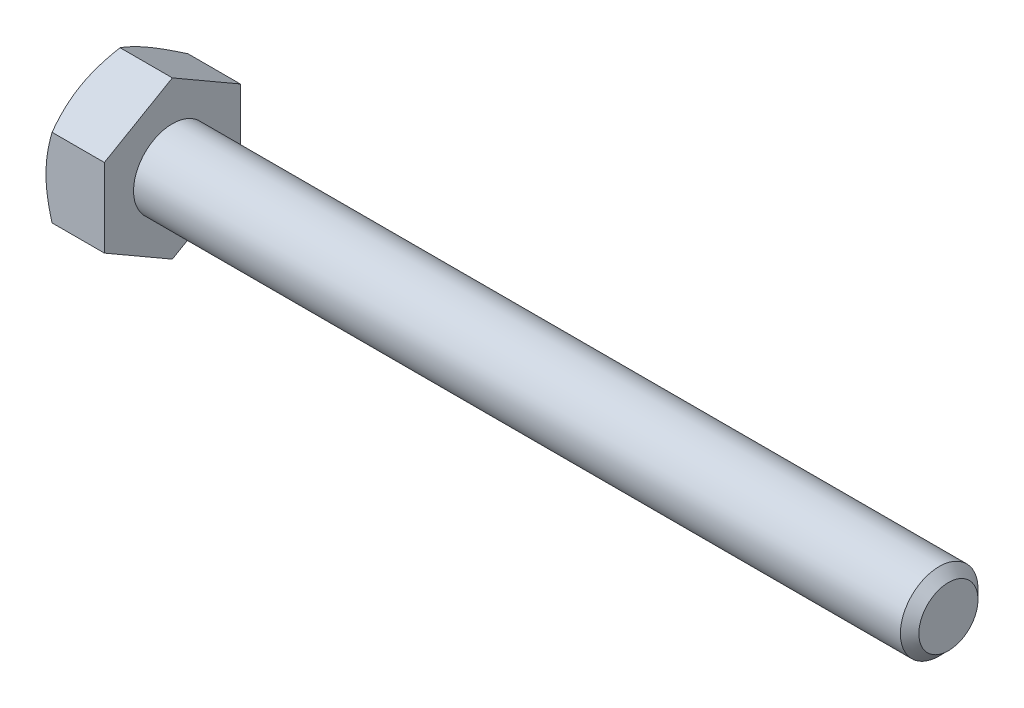
ISO-10303-21;
HEADER;
FILE_DESCRIPTION(('STEP AP214'),'2;1');
FILE_NAME('part.step','',(''),(''),'','','');
FILE_SCHEMA(('AUTOMOTIVE_DESIGN { 1 0 10303 214 1 1 1 1 }'));
ENDSEC;
DATA;
#1=APPLICATION_CONTEXT('core data for automotive mechanical design processes');
#2=APPLICATION_PROTOCOL_DEFINITION('international standard','automotive_design',2000,#1);
#3=PRODUCT_CONTEXT('',#1,'mechanical');
#4=PRODUCT('Part','Part','',(#3));
#5=PRODUCT_RELATED_PRODUCT_CATEGORY('part','',(#4));
#6=PRODUCT_DEFINITION_FORMATION('','',#4);
#7=PRODUCT_DEFINITION_CONTEXT('part definition',#1,'design');
#8=PRODUCT_DEFINITION('design','',#6,#7);
#9=PRODUCT_DEFINITION_SHAPE('','',#8);
#10=(LENGTH_UNIT() NAMED_UNIT(*) SI_UNIT(.MILLI.,.METRE.));
#11=(NAMED_UNIT(*) PLANE_ANGLE_UNIT() SI_UNIT($,.RADIAN.));
#12=(NAMED_UNIT(*) SI_UNIT($,.STERADIAN.) SOLID_ANGLE_UNIT());
#13=UNCERTAINTY_MEASURE_WITH_UNIT(LENGTH_MEASURE(1.E-05),#10,'distance_accuracy_value','');
#14=(GEOMETRIC_REPRESENTATION_CONTEXT(3) GLOBAL_UNCERTAINTY_ASSIGNED_CONTEXT((#13)) GLOBAL_UNIT_ASSIGNED_CONTEXT((#10,
#11,#12)) REPRESENTATION_CONTEXT('',''));
#15=CARTESIAN_POINT('',(0.,0.,0.));
#16=DIRECTION('',(0.,0.,1.));
#17=DIRECTION('',(1.,0.,0.));
#18=AXIS2_PLACEMENT_3D('',#15,#16,#17);
#19=CARTESIAN_POINT('',(4.7752,3.21156860739421,-5.5626));
#20=DIRECTION('',(0.,-0.866025403784438,0.500000000000001));
#21=DIRECTION('',(0.,-0.500000000000001,-0.866025403784438));
#22=AXIS2_PLACEMENT_3D('',#19,#20,#21);
#23=PLANE('',#22);
#24=CARTESIAN_POINT('',(0.496898061070143,6.42325268484227,0.0002));
#25=CARTESIAN_POINT('',(0.45614620225513,6.35265858120791,-0.122072574209491));
#26=CARTESIAN_POINT('',(0.417243775308723,6.2818012683745,-0.244801040124762));
#27=CARTESIAN_POINT('',(0.343647161560542,6.13951120287093,-0.491254662989243));
#28=CARTESIAN_POINT('',(0.308954790139044,6.06807821602765,-0.614980225538197));
#29=CARTESIAN_POINT('',(0.211873701066855,5.85263550648139,-0.98813794459262));
#30=CARTESIAN_POINT('',(0.156654841923373,5.70777535201369,-1.23904309212296));
#31=CARTESIAN_POINT('',(0.0919037861815275,5.49099476252075,-1.61451808721946));
#32=CARTESIAN_POINT('',(0.0734579983429333,5.41972205873199,-1.7379660313744));
#33=CARTESIAN_POINT('',(0.0425268916674615,5.27685459691414,-1.98541973399132));
#34=CARTESIAN_POINT('',(0.030041046189008,5.20525986790488,-2.10942544218948));
#35=CARTESIAN_POINT('',(0.0113480299394708,5.06194605565757,-2.35765224642821));
#36=CARTESIAN_POINT('',(0.00513373340584708,4.9902272065059,-2.48187293701928));
#37=CARTESIAN_POINT('',(-0.000889599359095551,4.84672720555795,-2.7304222295473));
#38=CARTESIAN_POINT('',(-0.000698833448296274,4.7749460557547,-2.85475082803225));
#39=CARTESIAN_POINT('',(0.00862810136342285,4.57828637012706,-3.19537539533985));
#40=CARTESIAN_POINT('',(0.0242873955350757,4.4534722013835,-3.41155987710816));
#41=CARTESIAN_POINT('',(0.0739443233816052,4.20467287416474,-3.84249295274001));
#42=CARTESIAN_POINT('',(0.107958931423458,4.08068859075412,-4.05724003094723));
#43=CARTESIAN_POINT('',(0.192986041409677,3.83138850679899,-4.4890404426887));
#44=CARTESIAN_POINT('',(0.244358813937401,3.70610416511176,-4.70603928788379));
#45=CARTESIAN_POINT('',(0.360954456999593,3.45740388365365,-5.13680081122592));
#46=CARTESIAN_POINT('',(0.426149937617058,3.33398475856357,-5.35056900650764));
#47=CARTESIAN_POINT('',(0.496898061070137,3.21145313734037,-5.5628));
#48=B_SPLINE_CURVE_WITH_KNOTS('',3,(#24,#25,#26,#27,#28,#29,#30,#31,#32,#33,#34,#35,#36,#37,#38,
#39,#40,#41,#42,#43,#44,#45,#46,#47),.UNSPECIFIED.,.F.,.F.,(4,2,2,2,2,2,2,2,2,2,2,4),(0.,
0.44082011856227,0.8818296488474,1.76568130465017,2.19678242164486,2.62784543796583,
3.05841812523868,3.48897751176353,4.23854798324166,4.98881282275669,5.75571809391027,
6.52111769989992),.UNSPECIFIED.);
#49=CARTESIAN_POINT('',(0.496831392605788,6.42313721478843,0.));
#50=VERTEX_POINT('',#49);
#51=CARTESIAN_POINT('',(0.,4.81735291109131,-2.78130000000001));
#52=VERTEX_POINT('',#51);
#53=EDGE_CURVE('E51',#50,#52,#48,.T.);
#54=ORIENTED_EDGE('',*,*,#53,.F.);
#55=DIRECTION('',(-1.,0.,0.));
#56=VECTOR('',#55,1.);
#57=CARTESIAN_POINT('',(4.7752,6.42313721478843,0.));
#58=LINE('',#57,#56);
#59=CARTESIAN_POINT('',(4.7752,6.42313721478843,0.));
#60=VERTEX_POINT('',#59);
#61=EDGE_CURVE('E147',#60,#50,#58,.T.);
#62=ORIENTED_EDGE('',*,*,#61,.F.);
#63=DIRECTION('',(0.,0.500000000000001,0.866025403784438));
#64=VECTOR('',#63,1.);
#65=CARTESIAN_POINT('',(4.7752,3.21156860739421,-5.5626));
#66=LINE('',#65,#64);
#67=CARTESIAN_POINT('',(4.7752,3.21156860739421,-5.5626));
#68=VERTEX_POINT('',#67);
#69=EDGE_CURVE('E238',#68,#60,#66,.T.);
#70=ORIENTED_EDGE('',*,*,#69,.F.);
#71=DIRECTION('',(-1.,0.,0.));
#72=VECTOR('',#71,1.);
#73=CARTESIAN_POINT('',(4.7752,3.21156860739421,-5.5626));
#74=LINE('',#73,#72);
#75=CARTESIAN_POINT('',(0.496831392605783,3.21156860739421,-5.5626));
#76=VERTEX_POINT('',#75);
#77=EDGE_CURVE('E135',#68,#76,#74,.T.);
#78=ORIENTED_EDGE('',*,*,#77,.T.);
#79=EDGE_CURVE('E129',#52,#76,#48,.T.);
#80=ORIENTED_EDGE('',*,*,#79,.F.);
#81=EDGE_LOOP('',(#54,#62,#70,#78,#80));
#82=FACE_BOUND('',#81,.T.);
#83=ADVANCED_FACE('F35',(#82),#23,.F.);
#84=CARTESIAN_POINT('',(4.7752,6.42313721478843,0.));
#85=DIRECTION('',(0.,-0.866025403784438,-0.500000000000001));
#86=DIRECTION('',(0.,0.500000000000001,-0.866025403784438));
#87=AXIS2_PLACEMENT_3D('',#84,#85,#86);
#88=PLANE('',#87);
#89=CARTESIAN_POINT('',(0.496898061070137,3.21145313734037,5.5628));
#90=CARTESIAN_POINT('',(0.456146202255126,3.28204724097473,5.44052742579051));
#91=CARTESIAN_POINT('',(0.417243775308719,3.35290455380814,5.31779895987524));
#92=CARTESIAN_POINT('',(0.343647161560538,3.49519461931171,5.07134533701076));
#93=CARTESIAN_POINT('',(0.30895479013904,3.56662760615498,4.9476197744618));
#94=CARTESIAN_POINT('',(0.211873701066851,3.78207031570124,4.57446205540738));
#95=CARTESIAN_POINT('',(0.156654841923371,3.92693047016895,4.32355690787704));
#96=CARTESIAN_POINT('',(0.0919037861815261,4.14371105966188,3.94808191278055));
#97=CARTESIAN_POINT('',(0.0734579983429319,4.21498376345064,3.82463396862561));
#98=CARTESIAN_POINT('',(0.0425268916674603,4.35785122526849,3.57718026600868));
#99=CARTESIAN_POINT('',(0.0300410461890069,4.42944595427775,3.45317455781052));
#100=CARTESIAN_POINT('',(0.0113480299394699,4.57275976652506,3.20494775357179));
#101=CARTESIAN_POINT('',(0.00513373340584611,4.64447861567674,3.08072706298073));
#102=CARTESIAN_POINT('',(-0.000889599359095831,4.78797861662468,2.8321777704527));
#103=CARTESIAN_POINT('',(-0.000698833448295828,4.85975976642794,2.70784917196775));
#104=CARTESIAN_POINT('',(0.00862810136342449,5.05641945205558,2.36722460466016));
#105=CARTESIAN_POINT('',(0.0242873955350772,5.18123362079914,2.15104012289184));
#106=CARTESIAN_POINT('',(0.0739443233816073,5.4300329480179,1.72010704725999));
#107=CARTESIAN_POINT('',(0.107958931423461,5.55401723142852,1.50535996905277));
#108=CARTESIAN_POINT('',(0.19298604140968,5.80331731538365,1.0735595573113));
#109=CARTESIAN_POINT('',(0.244358813937405,5.92860165707088,0.856560712116213));
#110=CARTESIAN_POINT('',(0.360954456999597,6.17730193852899,0.425799188774084));
#111=CARTESIAN_POINT('',(0.426149937617063,6.30072106361907,0.212030993492364));
#112=CARTESIAN_POINT('',(0.496898061070143,6.42325268484227,-0.000200000000000001));
#113=B_SPLINE_CURVE_WITH_KNOTS('',3,(#89,#90,#91,#92,#93,#94,#95,#96,#97,#98,#99,#100,#101,#102,
#103,#104,#105,#106,#107,#108,#109,#110,#111,#112),.UNSPECIFIED.,.F.,.F.,(4,2,2,2,2,2,2,2,2,2,2,
4),(0.,0.440820118562269,0.881829648847399,1.76568130465016,2.19678242164486,2.62784543796582,
3.05841812523867,3.48897751176352,4.23854798324166,4.98881282275669,5.75571809391027,
6.52111769989992),.UNSPECIFIED.);
#114=CARTESIAN_POINT('',(0.496831392605783,3.21156860739421,5.5626));
#115=VERTEX_POINT('',#114);
#116=CARTESIAN_POINT('',(0.,4.81735291109131,2.78130000000001));
#117=VERTEX_POINT('',#116);
#118=EDGE_CURVE('E58',#115,#117,#113,.T.);
#119=ORIENTED_EDGE('',*,*,#118,.F.);
#120=DIRECTION('',(-1.,0.,0.));
#121=VECTOR('',#120,1.);
#122=CARTESIAN_POINT('',(4.7752,3.21156860739421,5.5626));
#123=LINE('',#122,#121);
#124=CARTESIAN_POINT('',(4.7752,3.21156860739421,5.5626));
#125=VERTEX_POINT('',#124);
#126=EDGE_CURVE('E145',#125,#115,#123,.T.);
#127=ORIENTED_EDGE('',*,*,#126,.F.);
#128=DIRECTION('',(0.,-0.500000000000001,0.866025403784438));
#129=VECTOR('',#128,1.);
#130=CARTESIAN_POINT('',(4.7752,6.42313721478843,0.));
#131=LINE('',#130,#129);
#132=EDGE_CURVE('E236',#60,#125,#131,.T.);
#133=ORIENTED_EDGE('',*,*,#132,.F.);
#134=ORIENTED_EDGE('',*,*,#61,.T.);
#135=EDGE_CURVE('E162',#117,#50,#113,.T.);
#136=ORIENTED_EDGE('',*,*,#135,.F.);
#137=EDGE_LOOP('',(#119,#127,#133,#134,#136));
#138=FACE_BOUND('',#137,.T.);
#139=ADVANCED_FACE('F168',(#138),#88,.F.);
#140=CARTESIAN_POINT('',(4.7752,3.21156860739421,5.5626));
#141=DIRECTION('',(0.,0.,-1.));
#142=DIRECTION('',(0.,1.,0.));
#143=AXIS2_PLACEMENT_3D('',#140,#141,#142);
#144=PLANE('',#143);
#145=CARTESIAN_POINT('',(2.76946298300578,-8.7393190750818,5.5626));
#146=CARTESIAN_POINT('',(2.65067477861527,-8.49536496655185,5.5626));
#147=CARTESIAN_POINT('',(2.53299354463682,-8.25086273482907,5.5626));
#148=CARTESIAN_POINT('',(2.30046552472367,-7.7604709003827,5.5626));
#149=CARTESIAN_POINT('',(2.18561916460972,-7.51458109596807,5.5626));
#150=CARTESIAN_POINT('',(1.9588276573177,-7.01990967875911,5.5626));
#151=CARTESIAN_POINT('',(1.84690075513499,-6.77111967311546,5.5626));
#152=CARTESIAN_POINT('',(1.62748022476041,-6.27159952967086,5.5626));
#153=CARTESIAN_POINT('',(1.51998639425647,-6.02086948102923,5.5626));
#154=CARTESIAN_POINT('',(1.30708686388974,-5.50862062722722,5.5626));
#155=CARTESIAN_POINT('',(1.20187213532634,-5.24702202923404,5.5626));
#156=CARTESIAN_POINT('',(0.999136459179914,-4.72080610855177,5.5626));
#157=CARTESIAN_POINT('',(0.901616358819185,-4.45618845710902,5.5626));
#158=CARTESIAN_POINT('',(0.716747077259983,-3.92397402708936,5.5626));
#159=CARTESIAN_POINT('',(0.629378259967496,-3.65638413524642,5.5626));
#160=CARTESIAN_POINT('',(0.467540995587162,-3.11736467473257,5.5626));
#161=CARTESIAN_POINT('',(0.393068604009403,-2.84593630766607,5.5626));
#162=CARTESIAN_POINT('',(0.260913640631057,-2.30059524064209,5.5626));
#163=CARTESIAN_POINT('',(0.203137923936712,-2.02670547200284,5.5626));
#164=CARTESIAN_POINT('',(0.107584140927259,-1.47536640564423,5.5626));
#165=CARTESIAN_POINT('',(0.0698039297389937,-1.19791749297778,5.5626));
#166=CARTESIAN_POINT('',(0.0306329032322198,-0.782024036094212,5.5626));
#167=CARTESIAN_POINT('',(0.0205033243625241,-0.644369602420743,5.5626));
#168=CARTESIAN_POINT('',(0.00607539244269754,-0.368760083391723,5.5626));
#169=CARTESIAN_POINT('',(0.00177648777087112,-0.230805027714104,5.5626));
#170=CARTESIAN_POINT('',(-0.000882415982739105,0.0451740127451351,5.5626));
#171=CARTESIAN_POINT('',(0.000758104232646437,0.183198002498892,5.5626));
#172=CARTESIAN_POINT('',(0.0099357013266243,0.459040079963629,5.5626));
#173=CARTESIAN_POINT('',(0.017472551860389,0.596858175374894,5.5626));
#174=CARTESIAN_POINT('',(0.0422505229084576,0.924672768817545,5.5626));
#175=CARTESIAN_POINT('',(0.0620998983879061,1.11447655248114,5.5626));
#176=CARTESIAN_POINT('',(0.111925243816852,1.49274006022234,5.5626));
#177=CARTESIAN_POINT('',(0.141902493413722,1.68119961138342,5.5626));
#178=CARTESIAN_POINT('',(0.24544179513394,2.24430469271528,5.5626));
#179=CARTESIAN_POINT('',(0.332595182135706,2.61648784181075,5.5626));
#180=CARTESIAN_POINT('',(0.484580657527375,3.17327423362328,5.5626));
#181=CARTESIAN_POINT('',(0.53953514834987,3.3607403414357,5.5626));
#182=CARTESIAN_POINT('',(0.655361857948686,3.73385345534553,5.5626));
#183=CARTESIAN_POINT('',(0.716234121733455,3.91950044759557,5.5626));
#184=CARTESIAN_POINT('',(0.842902269493743,4.28903174270243,5.5626));
#185=CARTESIAN_POINT('',(0.908696734383907,4.47291653649099,5.5626));
#186=CARTESIAN_POINT('',(1.04441413366768,4.83914665056041,5.5626));
#187=CARTESIAN_POINT('',(1.11433697738278,5.02149200455408,5.5626));
#188=CARTESIAN_POINT('',(1.30616254258249,5.50788800286082,5.5626));
#189=CARTESIAN_POINT('',(1.43118964362203,5.81070522079332,5.5626));
#190=CARTESIAN_POINT('',(1.68847909941209,6.41326146735257,5.5626));
#191=CARTESIAN_POINT('',(1.82074222486502,6.71300016403481,5.5626));
#192=CARTESIAN_POINT('',(2.09080854484645,7.31009693194883,5.5626));
#193=CARTESIAN_POINT('',(2.2286137757305,7.6074540790974,5.5626));
#194=CARTESIAN_POINT('',(2.50845292691855,8.200151033603,5.5626));
#195=CARTESIAN_POINT('',(2.65048668230203,8.49549091908618,5.5626));
#196=CARTESIAN_POINT('',(2.93809441213762,9.08501121353831,5.5626));
#197=CARTESIAN_POINT('',(3.08367358186693,9.37918908275013,5.5626));
#198=CARTESIAN_POINT('',(3.37748078904249,9.96621951864085,5.5626));
#199=CARTESIAN_POINT('',(3.52570884757214,10.2590720747479,5.5626));
#200=CARTESIAN_POINT('',(3.97349977904317,11.1358830052649,5.5626));
#201=CARTESIAN_POINT('',(4.27623214178692,11.7182219945537,5.5626));
#202=CARTESIAN_POINT('',(4.85550678228881,12.8193647810355,5.5626));
#203=CARTESIAN_POINT('',(5.13148986853602,13.3384641758492,5.5626));
#204=CARTESIAN_POINT('',(5.68680572895233,14.3749069872875,5.5626));
#205=CARTESIAN_POINT('',(5.96613870161307,14.8922502975047,5.5626));
#206=CARTESIAN_POINT('',(6.52636532741208,15.9238879385591,5.5626));
#207=CARTESIAN_POINT('',(6.80725083144907,16.4381867017065,5.5626));
#208=CARTESIAN_POINT('',(7.37092859266393,17.4656872191565,5.5626));
#209=CARTESIAN_POINT('',(7.65372070150566,17.9788890548015,5.5626));
#210=CARTESIAN_POINT('',(7.93720779623422,18.4917042787924,5.5626));
#211=B_SPLINE_CURVE_WITH_KNOTS('',3,(#145,#146,#147,#148,#149,#150,#151,#152,#153,#154,#155,
#156,#157,#158,#159,#160,#161,#162,#163,#164,#165,#166,#167,#168,#169,#170,#171,#172,#173,#174,
#175,#176,#177,#178,#179,#180,#181,#182,#183,#184,#185,#186,#187,#188,#189,#190,#191,#192,#193,
#194,#195,#196,#197,#198,#199,#200,#201,#202,#203,#204,#205,#206,#207,#208,#209,#210),
.UNSPECIFIED.,.F.,.F.,(4,2,2,2,2,2,2,2,2,2,2,2,2,2,2,2,2,2,2,2,2,2,2,2,2,2,2,2,2,2,2,2,4),(0.,
0.814023059896039,1.62816765754195,2.44655638702215,3.26490772627512,4.11070764230637,
4.95660055613667,5.80082897545883,6.64479872196119,7.48396511886282,8.32304148200848,
8.73701668482869,9.15095272002817,9.56492494745271,9.97888128433686,10.5510771721585,
11.1233453834466,12.2684477479276,12.8544603660259,13.4404774414739,14.0263262127401,
14.6121621208114,15.5948602808078,16.5776633116356,17.5608308169621,18.5439600269871,
19.5286286939573,20.5133052017346,22.4822323672198,24.245931208995,26.0097350771296,
27.7677407362569,29.5256111634693),.UNSPECIFIED.);
#212=CARTESIAN_POINT('',(0.496831392605779,-3.21156860739419,5.5626));
#213=VERTEX_POINT('',#212);
#214=CARTESIAN_POINT('',(0.,0.,5.5626));
#215=VERTEX_POINT('',#214);
#216=EDGE_CURVE('E248',#213,#215,#211,.T.);
#217=ORIENTED_EDGE('',*,*,#216,.F.);
#218=DIRECTION('',(-1.,0.,0.));
#219=VECTOR('',#218,1.);
#220=CARTESIAN_POINT('',(4.7752,-3.21156860739419,5.5626));
#221=LINE('',#220,#219);
#222=CARTESIAN_POINT('',(4.7752,-3.21156860739419,5.5626));
#223=VERTEX_POINT('',#222);
#224=EDGE_CURVE('E137',#223,#213,#221,.T.);
#225=ORIENTED_EDGE('',*,*,#224,.F.);
#226=DIRECTION('',(0.,-1.,0.));
#227=VECTOR('',#226,1.);
#228=CARTESIAN_POINT('',(4.7752,3.21156860739421,5.5626));
#229=LINE('',#228,#227);
#230=EDGE_CURVE('E232',#125,#223,#229,.T.);
#231=ORIENTED_EDGE('',*,*,#230,.F.);
#232=ORIENTED_EDGE('',*,*,#126,.T.);
#233=EDGE_CURVE('E186',#215,#115,#211,.T.);
#234=ORIENTED_EDGE('',*,*,#233,.F.);
#235=EDGE_LOOP('',(#217,#225,#231,#232,#234));
#236=FACE_BOUND('',#235,.T.);
#237=ADVANCED_FACE('F254',(#236),#144,.F.);
#238=CARTESIAN_POINT('',(4.7752,-6.42313721478842,0.));
#239=DIRECTION('',(0.,0.866025403784438,-0.500000000000002));
#240=DIRECTION('',(0.,0.500000000000002,0.866025403784438));
#241=AXIS2_PLACEMENT_3D('',#238,#239,#240);
#242=PLANE('',#241);
#243=CARTESIAN_POINT('',(0.496898061070138,-6.42325268484226,-0.000200000000000038));
#244=CARTESIAN_POINT('',(0.456146202255126,-6.3526585812079,0.122072574209491));
#245=CARTESIAN_POINT('',(0.417243775308719,-6.28180126837449,0.244801040124762));
#246=CARTESIAN_POINT('',(0.343647161560538,-6.13951120287092,0.491254662989243));
#247=CARTESIAN_POINT('',(0.30895479013904,-6.06807821602765,0.614980225538197));
#248=CARTESIAN_POINT('',(0.21187370106685,-5.85263550648139,0.988137944592619));
#249=CARTESIAN_POINT('',(0.156654841923369,-5.70777535201368,1.23904309212296));
#250=CARTESIAN_POINT('',(0.0919037861815231,-5.49099476252075,1.61451808721945));
#251=CARTESIAN_POINT('',(0.0734579983429287,-5.41972205873199,1.73796603137439));
#252=CARTESIAN_POINT('',(0.0425268916674567,-5.27685459691413,1.98541973399132));
#253=CARTESIAN_POINT('',(0.0300410461890033,-5.20525986790488,2.10942544218948));
#254=CARTESIAN_POINT('',(0.0113480299394658,-5.06194605565756,2.35765224642821));
#255=CARTESIAN_POINT('',(0.00513373340584158,-4.99022720650589,2.48187293701927));
#256=CARTESIAN_POINT('',(-0.00088959935910106,-4.84672720555795,2.73042222954729));
#257=CARTESIAN_POINT('',(-0.000698833448301401,-4.77494605575469,2.85475082803225));
#258=CARTESIAN_POINT('',(0.00862810136341809,-4.57828637012705,3.19537539533984));
#259=CARTESIAN_POINT('',(0.0242873955350705,-4.45347220138349,3.41155987710816));
#260=CARTESIAN_POINT('',(0.0739443233815994,-4.20467287416473,3.84249295274001));
#261=CARTESIAN_POINT('',(0.107958931423452,-4.08068859075411,4.05724003094722));
#262=CARTESIAN_POINT('',(0.192986041409671,-3.83138850679897,4.48904044268869));
#263=CARTESIAN_POINT('',(0.244358813937396,-3.70610416511175,4.70603928788379));
#264=CARTESIAN_POINT('',(0.360954456999589,-3.45740388365364,5.13680081122591));
#265=CARTESIAN_POINT('',(0.426149937617054,-3.33398475856356,5.35056900650764));
#266=CARTESIAN_POINT('',(0.496898061070133,-3.21145313734036,5.5628));
#267=B_SPLINE_CURVE_WITH_KNOTS('',3,(#243,#244,#245,#246,#247,#248,#249,#250,#251,#252,#253,
#254,#255,#256,#257,#258,#259,#260,#261,#262,#263,#264,#265,#266),.UNSPECIFIED.,.F.,.F.,(4,2,2,
2,2,2,2,2,2,2,2,4),(0.,0.44082011856227,0.881829648847399,1.76568130465016,2.19678242164486,
2.62784543796583,3.05841812523868,3.48897751176352,4.23854798324166,4.98881282275669,
5.75571809391028,6.52111769989993),.UNSPECIFIED.);
#268=CARTESIAN_POINT('',(0.496831392605783,-6.42313721478842,0.));
#269=VERTEX_POINT('',#268);
#270=CARTESIAN_POINT('',(0.,-4.81735291109131,2.78130000000001));
#271=VERTEX_POINT('',#270);
#272=EDGE_CURVE('E170',#269,#271,#267,.T.);
#273=ORIENTED_EDGE('',*,*,#272,.F.);
#274=DIRECTION('',(-1.,0.,0.));
#275=VECTOR('',#274,1.);
#276=CARTESIAN_POINT('',(4.7752,-6.42313721478842,0.));
#277=LINE('',#276,#275);
#278=CARTESIAN_POINT('',(4.7752,-6.42313721478842,0.));
#279=VERTEX_POINT('',#278);
#280=EDGE_CURVE('E134',#279,#269,#277,.T.);
#281=ORIENTED_EDGE('',*,*,#280,.F.);
#282=DIRECTION('',(0.,-0.500000000000002,-0.866025403784438));
#283=VECTOR('',#282,1.);
#284=CARTESIAN_POINT('',(4.7752,-6.42313721478842,0.));
#285=LINE('',#284,#283);
#286=EDGE_CURVE('E230',#223,#279,#285,.T.);
#287=ORIENTED_EDGE('',*,*,#286,.F.);
#288=ORIENTED_EDGE('',*,*,#224,.T.);
#289=EDGE_CURVE('E172',#271,#213,#267,.T.);
#290=ORIENTED_EDGE('',*,*,#289,.F.);
#291=EDGE_LOOP('',(#273,#281,#287,#288,#290));
#292=FACE_BOUND('',#291,.T.);
#293=ADVANCED_FACE('F226',(#292),#242,.F.);
#294=CARTESIAN_POINT('',(4.7752,-3.21156860739422,-5.5626));
#295=DIRECTION('',(0.,0.866025403784439,0.499999999999999));
#296=DIRECTION('',(0.,-0.499999999999999,0.866025403784439));
#297=AXIS2_PLACEMENT_3D('',#294,#295,#296);
#298=PLANE('',#297);
#299=CARTESIAN_POINT('',(0.49689806107014,-3.21145313734038,-5.5628));
#300=CARTESIAN_POINT('',(0.456146202255128,-3.28204724097474,-5.44052742579051));
#301=CARTESIAN_POINT('',(0.417243775308721,-3.35290455380815,-5.31779895987524));
#302=CARTESIAN_POINT('',(0.343647161560541,-3.49519461931171,-5.07134533701076));
#303=CARTESIAN_POINT('',(0.308954790139042,-3.56662760615499,-4.9476197744618));
#304=CARTESIAN_POINT('',(0.211873701066853,-3.78207031570125,-4.57446205540738));
#305=CARTESIAN_POINT('',(0.156654841923372,-3.92693047016895,-4.32355690787704));
#306=CARTESIAN_POINT('',(0.0919037861815272,-4.14371105966189,-3.94808191278054));
#307=CARTESIAN_POINT('',(0.0734579983429331,-4.21498376345065,-3.8246339686256));
#308=CARTESIAN_POINT('',(0.0425268916674613,-4.3578512252685,-3.57718026600868));
#309=CARTESIAN_POINT('',(0.0300410461890077,-4.42944595427776,-3.45317455781052));
#310=CARTESIAN_POINT('',(0.0113480299394704,-4.57275976652507,-3.20494775357179));
#311=CARTESIAN_POINT('',(0.00513373340584659,-4.64447861567674,-3.08072706298072));
#312=CARTESIAN_POINT('',(-0.000889599359095559,-4.78797861662469,-2.8321777704527));
#313=CARTESIAN_POINT('',(-0.000698833448295763,-4.85975976642794,-2.70784917196775));
#314=CARTESIAN_POINT('',(0.00862810136342402,-5.05641945205558,-2.36722460466015));
#315=CARTESIAN_POINT('',(0.0242873955350764,-5.18123362079914,-2.15104012289184));
#316=CARTESIAN_POINT('',(0.0739443233816055,-5.4300329480179,-1.72010704725999));
#317=CARTESIAN_POINT('',(0.107958931423458,-5.55401723142852,-1.50535996905277));
#318=CARTESIAN_POINT('',(0.192986041409677,-5.80331731538365,-1.0735595573113));
#319=CARTESIAN_POINT('',(0.244358813937401,-5.92860165707087,-0.856560712116213));
#320=CARTESIAN_POINT('',(0.360954456999593,-6.17730193852898,-0.425799188774084));
#321=CARTESIAN_POINT('',(0.426149937617058,-6.30072106361906,-0.212030993492364));
#322=CARTESIAN_POINT('',(0.496898061070137,-6.42325268484226,0.000199999999999785));
#323=B_SPLINE_CURVE_WITH_KNOTS('',3,(#299,#300,#301,#302,#303,#304,#305,#306,#307,#308,#309,
#310,#311,#312,#313,#314,#315,#316,#317,#318,#319,#320,#321,#322),.UNSPECIFIED.,.F.,.F.,(4,2,2,
2,2,2,2,2,2,2,2,4),(0.,0.44082011856227,0.881829648847399,1.76568130465016,2.19678242164486,
2.62784543796583,3.05841812523868,3.48897751176353,4.23854798324166,4.98881282275669,
5.75571809391027,6.52111769989992),.UNSPECIFIED.);
#324=CARTESIAN_POINT('',(0.496831392605577,-3.21156860739453,-5.5626));
#325=VERTEX_POINT('',#324);
#326=CARTESIAN_POINT('',(0.,-4.81735291109132,-2.7813));
#327=VERTEX_POINT('',#326);
#328=EDGE_CURVE('E111',#325,#327,#323,.T.);
#329=ORIENTED_EDGE('',*,*,#328,.F.);
#330=DIRECTION('',(-1.,0.,0.));
#331=VECTOR('',#330,1.);
#332=CARTESIAN_POINT('',(4.7752,-3.21156860739422,-5.5626));
#333=LINE('',#332,#331);
#334=CARTESIAN_POINT('',(4.7752,-3.21156860739422,-5.5626));
#335=VERTEX_POINT('',#334);
#336=EDGE_CURVE('E125',#335,#325,#333,.T.);
#337=ORIENTED_EDGE('',*,*,#336,.F.);
#338=DIRECTION('',(0.,0.499999999999999,-0.866025403784439));
#339=VECTOR('',#338,1.);
#340=CARTESIAN_POINT('',(4.7752,-3.21156860739422,-5.5626));
#341=LINE('',#340,#339);
#342=EDGE_CURVE('E228',#279,#335,#341,.T.);
#343=ORIENTED_EDGE('',*,*,#342,.F.);
#344=ORIENTED_EDGE('',*,*,#280,.T.);
#345=EDGE_CURVE('E128',#327,#269,#323,.T.);
#346=ORIENTED_EDGE('',*,*,#345,.F.);
#347=EDGE_LOOP('',(#329,#337,#343,#344,#346));
#348=FACE_BOUND('',#347,.T.);
#349=ADVANCED_FACE('F123',(#348),#298,.F.);
#350=CARTESIAN_POINT('',(4.7752,3.21156860739421,-5.5626));
#351=DIRECTION('',(0.,0.,1.));
#352=DIRECTION('',(0.,-1.,0.));
#353=AXIS2_PLACEMENT_3D('',#350,#351,#352);
#354=PLANE('',#353);
#355=CARTESIAN_POINT('',(2.76946298300579,-8.73931907508182,-5.5626));
#356=CARTESIAN_POINT('',(2.65067477861528,-8.49536496655187,-5.5626));
#357=CARTESIAN_POINT('',(2.53299354463683,-8.25086273482909,-5.5626));
#358=CARTESIAN_POINT('',(2.30046552472368,-7.76047090038273,-5.5626));
#359=CARTESIAN_POINT('',(2.18561916460973,-7.51458109596809,-5.5626));
#360=CARTESIAN_POINT('',(1.95882765731771,-7.01990967875913,-5.5626));
#361=CARTESIAN_POINT('',(1.846900755135,-6.77111967311548,-5.5626));
#362=CARTESIAN_POINT('',(1.62748022476042,-6.27159952967089,-5.5626));
#363=CARTESIAN_POINT('',(1.51998639425648,-6.02086948102925,-5.5626));
#364=CARTESIAN_POINT('',(1.30708686388975,-5.50862062722724,-5.5626));
#365=CARTESIAN_POINT('',(1.20187213532635,-5.24702202923406,-5.5626));
#366=CARTESIAN_POINT('',(0.999136459179921,-4.72080610855179,-5.5626));
#367=CARTESIAN_POINT('',(0.901616358819192,-4.45618845710904,-5.5626));
#368=CARTESIAN_POINT('',(0.716747077259989,-3.92397402708938,-5.5626));
#369=CARTESIAN_POINT('',(0.629378259967502,-3.65638413524644,-5.5626));
#370=CARTESIAN_POINT('',(0.467540995587167,-3.11736467473259,-5.5626));
#371=CARTESIAN_POINT('',(0.393068604009408,-2.84593630766609,-5.5626));
#372=CARTESIAN_POINT('',(0.260913640631061,-2.3005952406421,-5.5626));
#373=CARTESIAN_POINT('',(0.203137923936715,-2.02670547200286,-5.5626));
#374=CARTESIAN_POINT('',(0.107584140927261,-1.47536640564425,-5.5626));
#375=CARTESIAN_POINT('',(0.0698039297389959,-1.19791749297779,-5.5626));
#376=CARTESIAN_POINT('',(0.0306329032322217,-0.782024036094228,-5.5626));
#377=CARTESIAN_POINT('',(0.0205033243625259,-0.644369602420759,-5.5626));
#378=CARTESIAN_POINT('',(0.00607539244269882,-0.368760083391737,-5.5626));
#379=CARTESIAN_POINT('',(0.00177648777087202,-0.230805027714119,-5.5626));
#380=CARTESIAN_POINT('',(-0.000882415982738997,0.0451740127451205,-5.5626));
#381=CARTESIAN_POINT('',(0.000758104232646156,0.183198002498878,-5.5626));
#382=CARTESIAN_POINT('',(0.00993570132662356,0.459040079963614,-5.5626));
#383=CARTESIAN_POINT('',(0.0174725518603882,0.596858175374879,-5.5626));
#384=CARTESIAN_POINT('',(0.0422505229084564,0.924672768817529,-5.5626));
#385=CARTESIAN_POINT('',(0.0620998983879045,1.11447655248113,-5.5626));
#386=CARTESIAN_POINT('',(0.111925243816849,1.49274006022233,-5.5626));
#387=CARTESIAN_POINT('',(0.141902493413719,1.6811996113834,-5.5626));
#388=CARTESIAN_POINT('',(0.245441795133936,2.24430469271526,-5.5626));
#389=CARTESIAN_POINT('',(0.332595182135701,2.61648784181073,-5.5626));
#390=CARTESIAN_POINT('',(0.484580657527369,3.17327423362326,-5.5626));
#391=CARTESIAN_POINT('',(0.539535148349865,3.36074034143568,-5.5626));
#392=CARTESIAN_POINT('',(0.655361857948679,3.7338534553455,-5.5626));
#393=CARTESIAN_POINT('',(0.716234121733449,3.91950044759555,-5.5626));
#394=CARTESIAN_POINT('',(0.842902269493736,4.28903174270241,-5.5626));
#395=CARTESIAN_POINT('',(0.908696734383899,4.47291653649097,-5.5626));
#396=CARTESIAN_POINT('',(1.04441413366767,4.83914665056038,-5.5626));
#397=CARTESIAN_POINT('',(1.11433697738277,5.02149200455406,-5.5626));
#398=CARTESIAN_POINT('',(1.30616254258248,5.5078880028608,-5.5626));
#399=CARTESIAN_POINT('',(1.43118964362202,5.81070522079329,-5.5626));
#400=CARTESIAN_POINT('',(1.68847909941208,6.41326146735254,-5.5626));
#401=CARTESIAN_POINT('',(1.82074222486501,6.71300016403479,-5.5626));
#402=CARTESIAN_POINT('',(2.09080854484644,7.31009693194881,-5.5626));
#403=CARTESIAN_POINT('',(2.22861377573049,7.60745407909738,-5.5626));
#404=CARTESIAN_POINT('',(2.50845292691854,8.20015103360298,-5.5626));
#405=CARTESIAN_POINT('',(2.65048668230202,8.49549091908616,-5.5626));
#406=CARTESIAN_POINT('',(2.93809441213761,9.08501121353829,-5.5626));
#407=CARTESIAN_POINT('',(3.08367358186692,9.37918908275011,-5.5626));
#408=CARTESIAN_POINT('',(3.37748078904248,9.96621951864084,-5.5626));
#409=CARTESIAN_POINT('',(3.52570884757214,10.2590720747478,-5.5626));
#410=CARTESIAN_POINT('',(3.97349977904316,11.1358830052649,-5.5626));
#411=CARTESIAN_POINT('',(4.27623214178691,11.7182219945536,-5.5626));
#412=CARTESIAN_POINT('',(4.8555067822888,12.8193647810355,-5.5626));
#413=CARTESIAN_POINT('',(5.13148986853601,13.3384641758492,-5.5626));
#414=CARTESIAN_POINT('',(5.68680572895232,14.3749069872875,-5.5626));
#415=CARTESIAN_POINT('',(5.96613870161306,14.8922502975047,-5.5626));
#416=CARTESIAN_POINT('',(6.52636532741208,15.9238879385591,-5.5626));
#417=CARTESIAN_POINT('',(6.80725083144907,16.4381867017065,-5.5626));
#418=CARTESIAN_POINT('',(7.37092859266394,17.4656872191565,-5.5626));
#419=CARTESIAN_POINT('',(7.65372070150567,17.9788890548015,-5.5626));
#420=CARTESIAN_POINT('',(7.93720779623422,18.4917042787924,-5.5626));
#421=B_SPLINE_CURVE_WITH_KNOTS('',3,(#355,#356,#357,#358,#359,#360,#361,#362,#363,#364,#365,
#366,#367,#368,#369,#370,#371,#372,#373,#374,#375,#376,#377,#378,#379,#380,#381,#382,#383,#384,
#385,#386,#387,#388,#389,#390,#391,#392,#393,#394,#395,#396,#397,#398,#399,#400,#401,#402,#403,
#404,#405,#406,#407,#408,#409,#410,#411,#412,#413,#414,#415,#416,#417,#418,#419,#420),
.UNSPECIFIED.,.F.,.F.,(4,2,2,2,2,2,2,2,2,2,2,2,2,2,2,2,2,2,2,2,2,2,2,2,2,2,2,2,2,2,2,2,4),(0.,
0.814023059896039,1.62816765754195,2.44655638702216,3.26490772627512,4.11070764230638,
4.95660055613668,5.80082897545884,6.6447987219612,7.48396511886283,8.32304148200849,
8.7370166848287,9.15095272002818,9.56492494745272,9.97888128433688,10.5510771721585,
11.1233453834466,12.2684477479276,12.8544603660259,13.4404774414739,14.0263262127401,
14.6121621208114,15.5948602808078,16.5776633116356,17.5608308169621,18.5439600269871,
19.5286286939574,20.5133052017346,22.4822323672198,24.245931208995,26.0097350771296,
27.7677407362569,29.5256111634693),.UNSPECIFIED.);
#422=CARTESIAN_POINT('',(0.,0.,-5.5626));
#423=VERTEX_POINT('',#422);
#424=EDGE_CURVE('E117',#76,#423,#421,.F.);
#425=ORIENTED_EDGE('',*,*,#424,.F.);
#426=ORIENTED_EDGE('',*,*,#77,.F.);
#427=DIRECTION('',(0.,1.,0.));
#428=VECTOR('',#427,1.);
#429=CARTESIAN_POINT('',(4.7752,3.21156860739421,-5.5626));
#430=LINE('',#429,#428);
#431=EDGE_CURVE('E133',#335,#68,#430,.T.);
#432=ORIENTED_EDGE('',*,*,#431,.F.);
#433=ORIENTED_EDGE('',*,*,#336,.T.);
#434=EDGE_CURVE('E108',#423,#325,#421,.F.);
#435=ORIENTED_EDGE('',*,*,#434,.F.);
#436=EDGE_LOOP('',(#425,#426,#432,#433,#435));
#437=FACE_BOUND('',#436,.T.);
#438=ADVANCED_FACE('F131',(#437),#354,.F.);
#439=CARTESIAN_POINT('',(4.7752,6.42313721478843,0.));
#440=DIRECTION('',(1.,0.,0.));
#441=DIRECTION('',(0.,0.,-1.));
#442=AXIS2_PLACEMENT_3D('',#439,#440,#441);
#443=PLANE('',#442);
#444=CARTESIAN_POINT('',(4.7752,0.,0.));
#445=DIRECTION('',(1.,0.,0.));
#446=DIRECTION('',(0.,0.,-1.));
#447=AXIS2_PLACEMENT_3D('',#444,#445,#446);
#448=CIRCLE('',#447,3.175);
#449=CARTESIAN_POINT('',(4.7752,0.,-3.175));
#450=VERTEX_POINT('',#449);
#451=EDGE_CURVE('E241',#450,#450,#448,.F.);
#452=ORIENTED_EDGE('',*,*,#451,.T.);
#453=EDGE_LOOP('',(#452));
#454=FACE_BOUND('',#453,.T.);
#455=ORIENTED_EDGE('',*,*,#69,.T.);
#456=ORIENTED_EDGE('',*,*,#132,.T.);
#457=ORIENTED_EDGE('',*,*,#230,.T.);
#458=ORIENTED_EDGE('',*,*,#286,.T.);
#459=ORIENTED_EDGE('',*,*,#342,.T.);
#460=ORIENTED_EDGE('',*,*,#431,.T.);
#461=EDGE_LOOP('',(#455,#456,#457,#458,#459,#460));
#462=FACE_BOUND('',#461,.T.);
#463=ADVANCED_FACE('F256',(#454,#462),#443,.T.);
#464=CARTESIAN_POINT('',(0.,0.,0.));
#465=DIRECTION('',(-1.,0.,0.));
#466=DIRECTION('',(0.,0.,1.));
#467=AXIS2_PLACEMENT_3D('',#464,#465,#466);
#468=CYLINDRICAL_SURFACE('',#467,3.175);
#469=ORIENTED_EDGE('',*,*,#451,.F.);
#470=EDGE_LOOP('',(#469));
#471=FACE_BOUND('',#470,.T.);
#472=CARTESIAN_POINT('',(67.51955,0.,0.));
#473=DIRECTION('',(-1.,0.,0.));
#474=DIRECTION('',(0.,0.,1.));
#475=AXIS2_PLACEMENT_3D('',#472,#473,#474);
#476=CIRCLE('',#475,3.175);
#477=CARTESIAN_POINT('',(67.51955,0.,3.175));
#478=VERTEX_POINT('',#477);
#479=EDGE_CURVE('E244',#478,#478,#476,.T.);
#480=ORIENTED_EDGE('',*,*,#479,.T.);
#481=EDGE_LOOP('',(#480));
#482=FACE_BOUND('',#481,.T.);
#483=ADVANCED_FACE('F287',(#471,#482),#468,.T.);
#484=CARTESIAN_POINT('',(68.2752,0.,0.));
#485=DIRECTION('',(-1.,0.,0.));
#486=DIRECTION('',(0.,0.,1.));
#487=AXIS2_PLACEMENT_3D('',#484,#485,#486);
#488=CONICAL_SURFACE('',#487,2.41935,0.785398163397433);
#489=ORIENTED_EDGE('',*,*,#479,.F.);
#490=EDGE_LOOP('',(#489));
#491=FACE_BOUND('',#490,.T.);
#492=CARTESIAN_POINT('',(68.2752,0.,0.));
#493=DIRECTION('',(-1.,0.,0.));
#494=DIRECTION('',(0.,0.,1.));
#495=AXIS2_PLACEMENT_3D('',#492,#493,#494);
#496=CIRCLE('',#495,2.41935);
#497=CARTESIAN_POINT('',(68.2752,0.,2.41935));
#498=VERTEX_POINT('',#497);
#499=EDGE_CURVE('E246',#498,#498,#496,.T.);
#500=ORIENTED_EDGE('',*,*,#499,.T.);
#501=EDGE_LOOP('',(#500));
#502=FACE_BOUND('',#501,.T.);
#503=ADVANCED_FACE('F290',(#491,#502),#488,.T.);
#504=CARTESIAN_POINT('',(68.2752,0.,0.));
#505=DIRECTION('',(-1.,0.,0.));
#506=DIRECTION('',(0.,0.,1.));
#507=AXIS2_PLACEMENT_3D('',#504,#505,#506);
#508=PLANE('',#507);
#509=ORIENTED_EDGE('',*,*,#499,.F.);
#510=EDGE_LOOP('',(#509));
#511=FACE_BOUND('',#510,.T.);
#512=ADVANCED_FACE('F200',(#511),#508,.F.);
#513=CARTESIAN_POINT('',(0.,0.,0.));
#514=DIRECTION('',(1.,0.,0.));
#515=DIRECTION('',(0.,0.,-1.));
#516=AXIS2_PLACEMENT_3D('',#513,#514,#515);
#517=CONICAL_SURFACE('',#516,5.5626,1.0471975511966);
#518=ORIENTED_EDGE('',*,*,#328,.T.);
#519=CARTESIAN_POINT('',(0.,0.,0.));
#520=DIRECTION('',(1.,0.,0.));
#521=DIRECTION('',(0.,0.,-1.));
#522=AXIS2_PLACEMENT_3D('',#519,#520,#521);
#523=CIRCLE('',#522,5.5626);
#524=EDGE_CURVE('E39',#327,#423,#523,.T.);
#525=ORIENTED_EDGE('',*,*,#524,.T.);
#526=ORIENTED_EDGE('',*,*,#434,.T.);
#527=EDGE_LOOP('',(#518,#525,#526));
#528=FACE_BOUND('',#527,.T.);
#529=ADVANCED_FACE('F110',(#528),#517,.T.);
#530=ORIENTED_EDGE('',*,*,#272,.T.);
#531=EDGE_CURVE('E152',#271,#327,#523,.T.);
#532=ORIENTED_EDGE('',*,*,#531,.T.);
#533=ORIENTED_EDGE('',*,*,#345,.T.);
#534=EDGE_LOOP('',(#530,#532,#533));
#535=FACE_BOUND('',#534,.T.);
#536=ADVANCED_FACE('F199',(#535),#517,.T.);
#537=ORIENTED_EDGE('',*,*,#216,.T.);
#538=EDGE_CURVE('E153',#215,#271,#523,.T.);
#539=ORIENTED_EDGE('',*,*,#538,.T.);
#540=ORIENTED_EDGE('',*,*,#289,.T.);
#541=EDGE_LOOP('',(#537,#539,#540));
#542=FACE_BOUND('',#541,.T.);
#543=ADVANCED_FACE('F194',(#542),#517,.T.);
#544=ORIENTED_EDGE('',*,*,#233,.T.);
#545=ORIENTED_EDGE('',*,*,#118,.T.);
#546=CARTESIAN_POINT('',(0.,0.,0.));
#547=DIRECTION('',(-1.,0.,0.));
#548=DIRECTION('',(0.,0.,1.));
#549=AXIS2_PLACEMENT_3D('',#546,#547,#548);
#550=CIRCLE('',#549,5.5626);
#551=EDGE_CURVE('E118',#215,#117,#550,.T.);
#552=ORIENTED_EDGE('',*,*,#551,.F.);
#553=EDGE_LOOP('',(#544,#545,#552));
#554=FACE_BOUND('',#553,.T.);
#555=ADVANCED_FACE('F198',(#554),#517,.T.);
#556=ORIENTED_EDGE('',*,*,#135,.T.);
#557=ORIENTED_EDGE('',*,*,#53,.T.);
#558=EDGE_CURVE('E44',#52,#117,#523,.T.);
#559=ORIENTED_EDGE('',*,*,#558,.T.);
#560=EDGE_LOOP('',(#556,#557,#559));
#561=FACE_BOUND('',#560,.T.);
#562=ADVANCED_FACE('F161',(#561),#517,.T.);
#563=ORIENTED_EDGE('',*,*,#79,.T.);
#564=ORIENTED_EDGE('',*,*,#424,.T.);
#565=EDGE_CURVE('E11',#423,#52,#523,.T.);
#566=ORIENTED_EDGE('',*,*,#565,.T.);
#567=EDGE_LOOP('',(#563,#564,#566));
#568=FACE_BOUND('',#567,.T.);
#569=ADVANCED_FACE('F259',(#568),#517,.T.);
#570=CARTESIAN_POINT('',(0.,6.42313721478843,0.));
#571=DIRECTION('',(1.,0.,0.));
#572=DIRECTION('',(0.,0.,-1.));
#573=AXIS2_PLACEMENT_3D('',#570,#571,#572);
#574=PLANE('',#573);
#575=ORIENTED_EDGE('',*,*,#565,.F.);
#576=ORIENTED_EDGE('',*,*,#524,.F.);
#577=ORIENTED_EDGE('',*,*,#531,.F.);
#578=ORIENTED_EDGE('',*,*,#538,.F.);
#579=ORIENTED_EDGE('',*,*,#551,.T.);
#580=ORIENTED_EDGE('',*,*,#558,.F.);
#581=EDGE_LOOP('',(#575,#576,#577,#578,#579,#580));
#582=FACE_BOUND('',#581,.T.);
#583=ADVANCED_FACE('F165',(#582),#574,.F.);
#584=CLOSED_SHELL('',(#83,#139,#237,#293,#349,#438,#463,#483,#503,#512,#529,#536,#543,#555,#562,
#569,#583));
#585=MANIFOLD_SOLID_BREP('B2',#584);
#586=ADVANCED_BREP_SHAPE_REPRESENTATION('',(#18,#585),#14);
#587=SHAPE_DEFINITION_REPRESENTATION(#9,#586);
ENDSEC;
END-ISO-10303-21;
